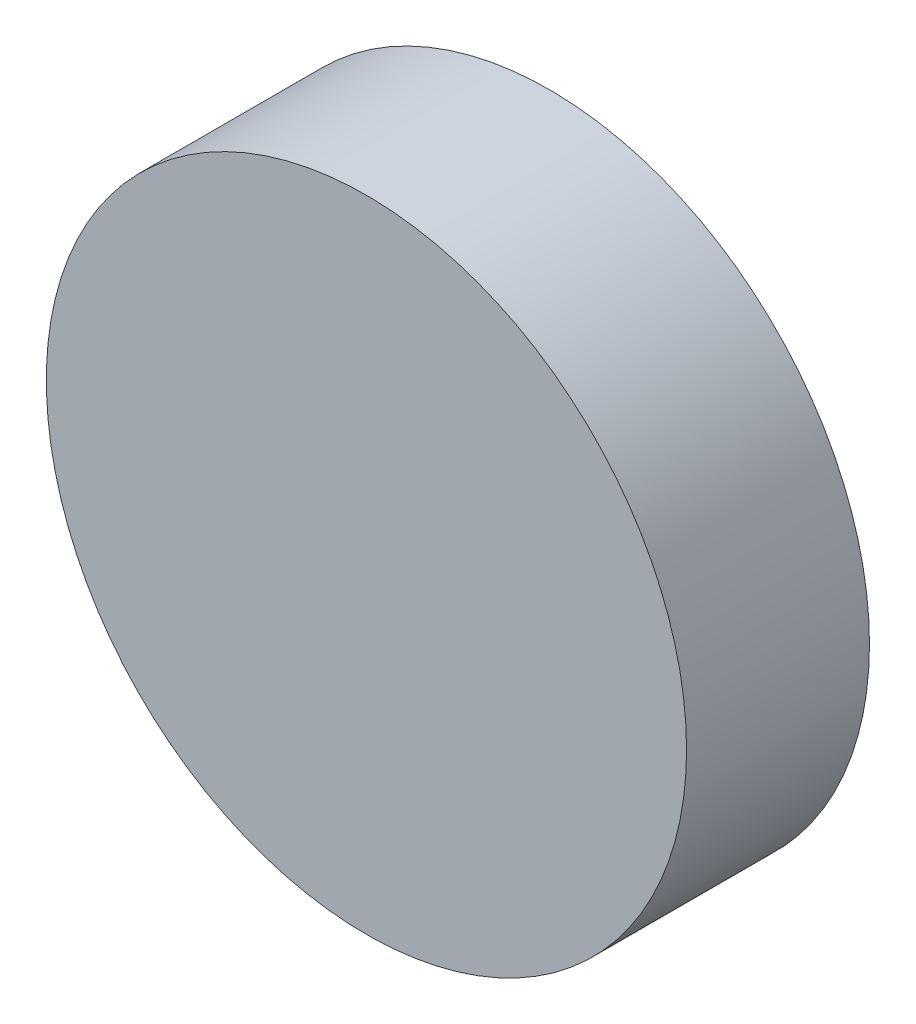
ISO-10303-21;
HEADER;
FILE_DESCRIPTION(('STEP AP214'),'2;1');
FILE_NAME('part.step','',(''),(''),'','','');
FILE_SCHEMA(('AUTOMOTIVE_DESIGN { 1 0 10303 214 1 1 1 1 }'));
ENDSEC;
DATA;
#1=APPLICATION_CONTEXT('core data for automotive mechanical design processes');
#2=APPLICATION_PROTOCOL_DEFINITION('international standard','automotive_design',2000,#1);
#3=PRODUCT_CONTEXT('',#1,'mechanical');
#4=PRODUCT('Part','Part','',(#3));
#5=PRODUCT_RELATED_PRODUCT_CATEGORY('part','',(#4));
#6=PRODUCT_DEFINITION_FORMATION('','',#4);
#7=PRODUCT_DEFINITION_CONTEXT('part definition',#1,'design');
#8=PRODUCT_DEFINITION('design','',#6,#7);
#9=PRODUCT_DEFINITION_SHAPE('','',#8);
#10=(LENGTH_UNIT() NAMED_UNIT(*) SI_UNIT(.MILLI.,.METRE.));
#11=(NAMED_UNIT(*) PLANE_ANGLE_UNIT() SI_UNIT($,.RADIAN.));
#12=(NAMED_UNIT(*) SI_UNIT($,.STERADIAN.) SOLID_ANGLE_UNIT());
#13=UNCERTAINTY_MEASURE_WITH_UNIT(LENGTH_MEASURE(1.E-05),#10,'distance_accuracy_value','');
#14=(GEOMETRIC_REPRESENTATION_CONTEXT(3) GLOBAL_UNCERTAINTY_ASSIGNED_CONTEXT((#13)) GLOBAL_UNIT_ASSIGNED_CONTEXT((#10,
#11,#12)) REPRESENTATION_CONTEXT('',''));
#15=CARTESIAN_POINT('',(0.,0.,0.));
#16=DIRECTION('',(0.,0.,1.));
#17=DIRECTION('',(1.,0.,0.));
#18=AXIS2_PLACEMENT_3D('',#15,#16,#17);
#19=CARTESIAN_POINT('',(0.,0.,3.175));
#20=DIRECTION('',(0.,0.,-1.));
#21=DIRECTION('',(-1.,0.,0.));
#22=AXIS2_PLACEMENT_3D('',#19,#20,#21);
#23=CYLINDRICAL_SURFACE('',#22,5.55625);
#24=CARTESIAN_POINT('',(0.,0.,3.175));
#25=DIRECTION('',(0.,0.,1.));
#26=DIRECTION('',(1.,0.,0.));
#27=AXIS2_PLACEMENT_3D('',#24,#25,#26);
#28=CIRCLE('',#27,5.55625);
#29=CARTESIAN_POINT('',(5.55625,0.,3.175));
#30=VERTEX_POINT('',#29);
#31=EDGE_CURVE('E10',#30,#30,#28,.T.);
#32=ORIENTED_EDGE('',*,*,#31,.F.);
#33=EDGE_LOOP('',(#32));
#34=FACE_BOUND('',#33,.T.);
#35=CARTESIAN_POINT('',(0.,0.,0.));
#36=DIRECTION('',(0.,0.,1.));
#37=DIRECTION('',(1.,0.,0.));
#38=AXIS2_PLACEMENT_3D('',#35,#36,#37);
#39=CIRCLE('',#38,5.55625);
#40=CARTESIAN_POINT('',(5.55625,0.,0.));
#41=VERTEX_POINT('',#40);
#42=EDGE_CURVE('E34',#41,#41,#39,.T.);
#43=ORIENTED_EDGE('',*,*,#42,.T.);
#44=EDGE_LOOP('',(#43));
#45=FACE_BOUND('',#44,.T.);
#46=ADVANCED_FACE('F31',(#34,#45),#23,.T.);
#47=CARTESIAN_POINT('',(0.,0.,3.175));
#48=DIRECTION('',(0.,0.,1.));
#49=DIRECTION('',(1.,0.,0.));
#50=AXIS2_PLACEMENT_3D('',#47,#48,#49);
#51=PLANE('',#50);
#52=ORIENTED_EDGE('',*,*,#31,.T.);
#53=EDGE_LOOP('',(#52));
#54=FACE_BOUND('',#53,.T.);
#55=ADVANCED_FACE('F46',(#54),#51,.T.);
#56=CARTESIAN_POINT('',(0.,0.,0.));
#57=DIRECTION('',(0.,0.,1.));
#58=DIRECTION('',(1.,0.,0.));
#59=AXIS2_PLACEMENT_3D('',#56,#57,#58);
#60=PLANE('',#59);
#61=ORIENTED_EDGE('',*,*,#42,.F.);
#62=EDGE_LOOP('',(#61));
#63=FACE_BOUND('',#62,.T.);
#64=ADVANCED_FACE('F44',(#63),#60,.F.);
#65=CLOSED_SHELL('',(#46,#55,#64));
#66=MANIFOLD_SOLID_BREP('B2',#65);
#67=ADVANCED_BREP_SHAPE_REPRESENTATION('',(#18,#66),#14);
#68=SHAPE_DEFINITION_REPRESENTATION(#9,#67);
ENDSEC;
END-ISO-10303-21;
